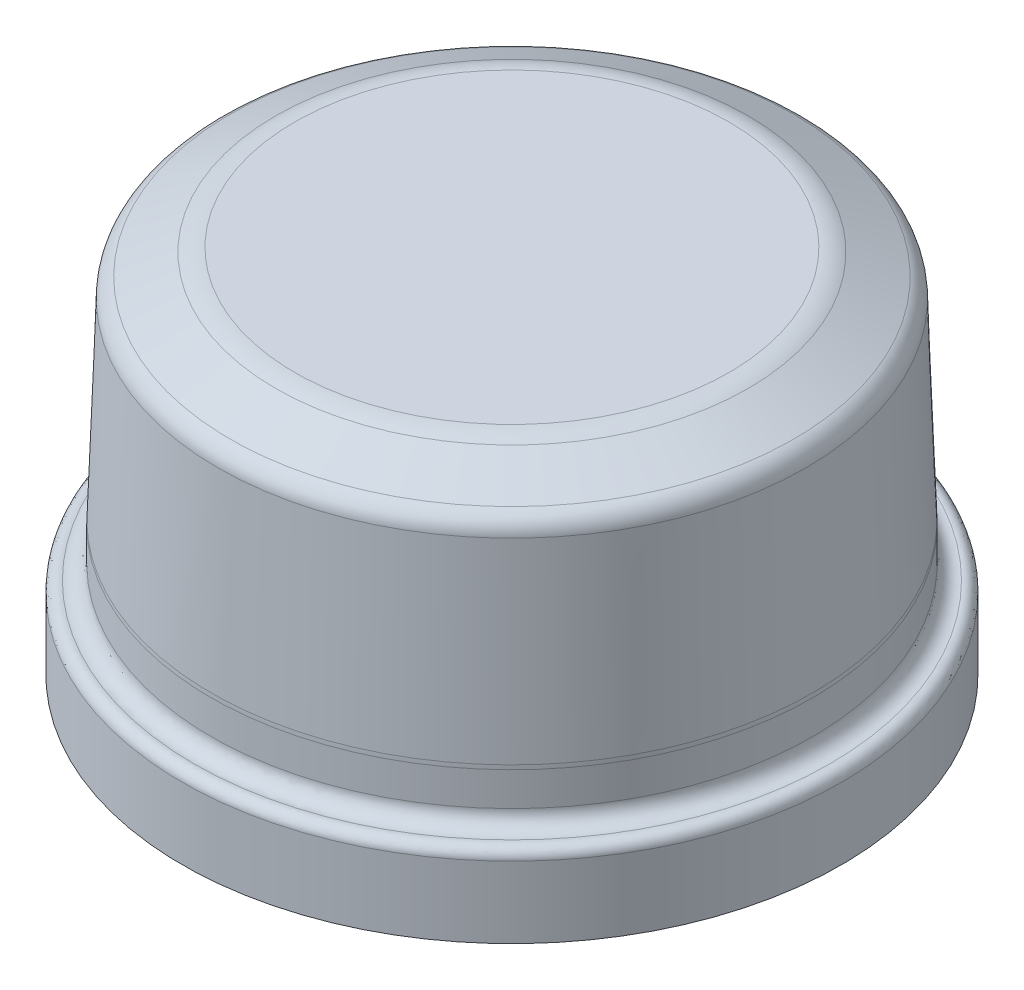
ISO-10303-21;
HEADER;
FILE_DESCRIPTION(('STEP AP214'),'2;1');
FILE_NAME('part.step','',(''),(''),'','','');
FILE_SCHEMA(('AUTOMOTIVE_DESIGN { 1 0 10303 214 1 1 1 1 }'));
ENDSEC;
DATA;
#1=APPLICATION_CONTEXT('core data for automotive mechanical design processes');
#2=APPLICATION_PROTOCOL_DEFINITION('international standard','automotive_design',2000,#1);
#3=PRODUCT_CONTEXT('',#1,'mechanical');
#4=PRODUCT('Part','Part','',(#3));
#5=PRODUCT_RELATED_PRODUCT_CATEGORY('part','',(#4));
#6=PRODUCT_DEFINITION_FORMATION('','',#4);
#7=PRODUCT_DEFINITION_CONTEXT('part definition',#1,'design');
#8=PRODUCT_DEFINITION('design','',#6,#7);
#9=PRODUCT_DEFINITION_SHAPE('','',#8);
#10=(LENGTH_UNIT() NAMED_UNIT(*) SI_UNIT(.MILLI.,.METRE.));
#11=(NAMED_UNIT(*) PLANE_ANGLE_UNIT() SI_UNIT($,.RADIAN.));
#12=(NAMED_UNIT(*) SI_UNIT($,.STERADIAN.) SOLID_ANGLE_UNIT());
#13=UNCERTAINTY_MEASURE_WITH_UNIT(LENGTH_MEASURE(1.E-05),#10,'distance_accuracy_value','');
#14=(GEOMETRIC_REPRESENTATION_CONTEXT(3) GLOBAL_UNCERTAINTY_ASSIGNED_CONTEXT((#13)) GLOBAL_UNIT_ASSIGNED_CONTEXT((#10,
#11,#12)) REPRESENTATION_CONTEXT('',''));
#15=CARTESIAN_POINT('',(0.,0.,0.));
#16=DIRECTION('',(0.,0.,1.));
#17=DIRECTION('',(1.,0.,0.));
#18=AXIS2_PLACEMENT_3D('',#15,#16,#17);
#19=CARTESIAN_POINT('',(0.,-142.400182818489,0.));
#20=DIRECTION('',(0.,1.,0.));
#21=DIRECTION('',(0.,0.,1.));
#22=AXIS2_PLACEMENT_3D('',#19,#20,#21);
#23=PLANE('',#22);
#24=CARTESIAN_POINT('',(0.,-142.400182818489,0.));
#25=DIRECTION('',(0.,-1.,0.));
#26=DIRECTION('',(0.,0.,-1.));
#27=AXIS2_PLACEMENT_3D('',#24,#25,#26);
#28=CIRCLE('',#27,135.227487940002);
#29=CARTESIAN_POINT('',(0.,-142.400182818489,-135.227487940002));
#30=VERTEX_POINT('',#29);
#31=EDGE_CURVE('E53',#30,#30,#28,.T.);
#32=ORIENTED_EDGE('',*,*,#31,.F.);
#33=EDGE_LOOP('',(#32));
#34=FACE_BOUND('',#33,.T.);
#35=CARTESIAN_POINT('',(0.,-142.400182818489,0.));
#36=DIRECTION('',(0.,-1.,0.));
#37=DIRECTION('',(0.,0.,-1.));
#38=AXIS2_PLACEMENT_3D('',#35,#36,#37);
#39=CIRCLE('',#38,138.427487940002);
#40=CARTESIAN_POINT('',(0.,-142.400182818489,-138.427487940002));
#41=VERTEX_POINT('',#40);
#42=EDGE_CURVE('E124',#41,#41,#39,.T.);
#43=ORIENTED_EDGE('',*,*,#42,.T.);
#44=EDGE_LOOP('',(#43));
#45=FACE_BOUND('',#44,.T.);
#46=ADVANCED_FACE('F35',(#34,#45),#23,.F.);
#47=CARTESIAN_POINT('',(0.,13.0472913738796,91.1860000000004));
#48=CARTESIAN_POINT('',(0.,13.0472913738796,93.9930756489206));
#49=CARTESIAN_POINT('',(0.,12.4331662406387,96.7096580848795));
#50=CARTESIAN_POINT('',(0.,11.2624547169268,99.2127252525065));
#51=(BOUNDED_CURVE() B_SPLINE_CURVE(3,(#47,#48,#49,#50),.UNSPECIFIED.,.F.,
.F.) B_SPLINE_CURVE_WITH_KNOTS((4,4),(0.,1.),
.UNSPECIFIED.) CURVE() GEOMETRIC_REPRESENTATION_ITEM() RATIONAL_B_SPLINE_CURVE((0.254333095030252,
0.254333095030252,0.258499793724843,0.266833191114025)) REPRESENTATION_ITEM(''));
#52=CARTESIAN_POINT('',(0.,55.,0.));
#53=DIRECTION('',(0.,-1.,0.));
#54=AXIS1_PLACEMENT('',#52,#53);
#55=SURFACE_OF_REVOLUTION('',#51,#54);
#56=OFFSET_SURFACE('',#55,-3.2,.F.);
#57=CARTESIAN_POINT('',(0.,8.36382953319206,0.));
#58=DIRECTION('',(0.,-1.,0.));
#59=DIRECTION('',(0.,0.,1.));
#60=AXIS2_PLACEMENT_3D('',#57,#58,#59);
#61=CIRCLE('',#60,97.8570069763817);
#62=CARTESIAN_POINT('',(0.,8.36382953319206,97.8570069763817));
#63=VERTEX_POINT('',#62);
#64=EDGE_CURVE('E42',#63,#63,#61,.T.);
#65=ORIENTED_EDGE('',*,*,#64,.T.);
#66=EDGE_LOOP('',(#65));
#67=FACE_BOUND('',#66,.T.);
#68=CARTESIAN_POINT('',(0.,9.84729137387958,0.));
#69=DIRECTION('',(0.,-1.,0.));
#70=DIRECTION('',(0.,0.,1.));
#71=AXIS2_PLACEMENT_3D('',#68,#69,#70);
#72=CIRCLE('',#71,91.1860000000004);
#73=CARTESIAN_POINT('',(0.,9.84729137387958,91.1860000000004));
#74=VERTEX_POINT('',#73);
#75=EDGE_CURVE('E10',#74,#74,#72,.T.);
#76=ORIENTED_EDGE('',*,*,#75,.F.);
#77=EDGE_LOOP('',(#76));
#78=FACE_BOUND('',#77,.T.);
#79=ADVANCED_FACE('F77',(#67,#78),#56,.F.);
#80=CARTESIAN_POINT('',(0.,2.24347505894726,0.));
#81=DIRECTION('',(0.,-1.,0.));
#82=DIRECTION('',(0.,0.,-1.));
#83=AXIS2_PLACEMENT_3D('',#80,#81,#82);
#84=CONICAL_SURFACE('',#83,110.942774074793,1.13331210913781);
#85=CARTESIAN_POINT('',(0.,-0.554291374192108,0.));
#86=DIRECTION('',(0.,-1.,0.));
#87=DIRECTION('',(0.,0.,-1.));
#88=AXIS2_PLACEMENT_3D('',#85,#86,#87);
#89=CIRCLE('',#88,116.924604064197);
#90=CARTESIAN_POINT('',(0.,-0.554291374192108,-116.924604064197));
#91=VERTEX_POINT('',#90);
#92=EDGE_CURVE('E47',#91,#91,#89,.T.);
#93=ORIENTED_EDGE('',*,*,#92,.T.);
#94=EDGE_LOOP('',(#93));
#95=FACE_BOUND('',#94,.T.);
#96=ORIENTED_EDGE('',*,*,#64,.F.);
#97=EDGE_LOOP('',(#96));
#98=FACE_BOUND('',#97,.T.);
#99=ADVANCED_FACE('F79',(#95,#98),#84,.F.);
#100=CARTESIAN_POINT('',(0.,-5.80804951971132,0.));
#101=DIRECTION('',(0.,-1.,0.));
#102=DIRECTION('',(0.,0.,-1.));
#103=AXIS2_PLACEMENT_3D('',#100,#101,#102);
#104=TOROIDAL_SURFACE('',#103,114.46736468872,5.8);
#105=CARTESIAN_POINT('',(0.,-5.60563243883684,0.));
#106=DIRECTION('',(0.,-1.,0.));
#107=DIRECTION('',(0.,0.,-1.));
#108=AXIS2_PLACEMENT_3D('',#105,#106,#107);
#109=CIRCLE('',#108,120.263831485431);
#110=CARTESIAN_POINT('',(0.,-5.60563243883684,-120.263831485431));
#111=VERTEX_POINT('',#110);
#112=EDGE_CURVE('E344',#111,#111,#109,.T.);
#113=ORIENTED_EDGE('',*,*,#112,.T.);
#114=EDGE_LOOP('',(#113));
#115=FACE_BOUND('',#114,.T.);
#116=ORIENTED_EDGE('',*,*,#92,.F.);
#117=EDGE_LOOP('',(#116));
#118=FACE_BOUND('',#117,.T.);
#119=ADVANCED_FACE('F82',(#115,#118),#104,.F.);
#120=CARTESIAN_POINT('',(0.,-5.60563243883685,0.));
#121=DIRECTION('',(0.,-1.,0.));
#122=DIRECTION('',(0.,0.,-1.));
#123=AXIS2_PLACEMENT_3D('',#120,#121,#122);
#124=CONICAL_SURFACE('',#123,120.263831485431,0.0349065850398867);
#125=CARTESIAN_POINT('',(0.,-86.0767033792557,0.));
#126=DIRECTION('',(0.,-1.,0.));
#127=DIRECTION('',(0.,0.,-1.));
#128=AXIS2_PLACEMENT_3D('',#125,#126,#127);
#129=CIRCLE('',#128,123.073943204496);
#130=CARTESIAN_POINT('',(0.,-86.0767033792557,-123.073943204496));
#131=VERTEX_POINT('',#130);
#132=EDGE_CURVE('E347',#131,#131,#129,.T.);
#133=ORIENTED_EDGE('',*,*,#132,.T.);
#134=EDGE_LOOP('',(#133));
#135=FACE_BOUND('',#134,.T.);
#136=ORIENTED_EDGE('',*,*,#112,.F.);
#137=EDGE_LOOP('',(#136));
#138=FACE_BOUND('',#137,.T.);
#139=ADVANCED_FACE('F86',(#135,#138),#124,.F.);
#140=CARTESIAN_POINT('',(0.,-87.709999824933,0.));
#141=DIRECTION('',(0.,-1.,0.));
#142=DIRECTION('',(0.,0.,-1.));
#143=AXIS2_PLACEMENT_3D('',#140,#141,#142);
#144=TOROIDAL_SURFACE('',#143,76.302452500002,46.8);
#145=CARTESIAN_POINT('',(0.,-87.7099998249327,0.));
#146=DIRECTION('',(0.,-1.,0.));
#147=DIRECTION('',(0.,0.,-1.));
#148=AXIS2_PLACEMENT_3D('',#145,#146,#147);
#149=CIRCLE('',#148,123.102452500002);
#150=CARTESIAN_POINT('',(0.,-87.7099998249327,-123.102452500002));
#151=VERTEX_POINT('',#150);
#152=EDGE_CURVE('E350',#151,#151,#149,.T.);
#153=ORIENTED_EDGE('',*,*,#152,.T.);
#154=EDGE_LOOP('',(#153));
#155=FACE_BOUND('',#154,.T.);
#156=ORIENTED_EDGE('',*,*,#132,.F.);
#157=EDGE_LOOP('',(#156));
#158=FACE_BOUND('',#157,.T.);
#159=ADVANCED_FACE('F90',(#155,#158),#144,.F.);
#160=CARTESIAN_POINT('',(0.,55.,0.));
#161=DIRECTION('',(0.,-1.,0.));
#162=DIRECTION('',(0.,0.,-1.));
#163=AXIS2_PLACEMENT_3D('',#160,#161,#162);
#164=CYLINDRICAL_SURFACE('',#163,123.102452500002);
#165=CARTESIAN_POINT('',(0.,-101.837246578522,0.));
#166=DIRECTION('',(0.,-1.,0.));
#167=DIRECTION('',(0.,0.,-1.));
#168=AXIS2_PLACEMENT_3D('',#165,#166,#167);
#169=CIRCLE('',#168,123.102452500002);
#170=CARTESIAN_POINT('',(0.,-101.837246578522,-123.102452500002));
#171=VERTEX_POINT('',#170);
#172=EDGE_CURVE('E353',#171,#171,#169,.T.);
#173=ORIENTED_EDGE('',*,*,#172,.T.);
#174=EDGE_LOOP('',(#173));
#175=FACE_BOUND('',#174,.T.);
#176=ORIENTED_EDGE('',*,*,#152,.F.);
#177=EDGE_LOOP('',(#176));
#178=FACE_BOUND('',#177,.T.);
#179=ADVANCED_FACE('F94',(#175,#178),#164,.F.);
#180=CARTESIAN_POINT('',(0.,-101.837246578522,126.302452500002));
#181=CARTESIAN_POINT('',(0.,-105.359484803612,126.302452500002));
#182=CARTESIAN_POINT('',(0.,-108.789131090786,128.834697888006));
#183=CARTESIAN_POINT('',(0.,-108.124708626121,133.519735500002));
#184=(BOUNDED_CURVE() B_SPLINE_CURVE(3,(#180,#181,#182,#183),.UNSPECIFIED.,.F.,
.F.) B_SPLINE_CURVE_WITH_KNOTS((4,4),(0.,1.),
.UNSPECIFIED.) CURVE() GEOMETRIC_REPRESENTATION_ITEM() RATIONAL_B_SPLINE_CURVE((0.508666190060503,
0.327183181081988,0.242825015050018,0.255591691964593)) REPRESENTATION_ITEM(''));
#185=CARTESIAN_POINT('',(0.,55.,0.));
#186=DIRECTION('',(0.,-1.,0.));
#187=AXIS1_PLACEMENT('',#185,#186);
#188=SURFACE_OF_REVOLUTION('',#184,#187);
#189=OFFSET_SURFACE('',#188,-3.2,.F.);
#190=CARTESIAN_POINT('',(0.,-111.293006305435,0.));
#191=DIRECTION('',(0.,-1.,0.));
#192=DIRECTION('',(0.,0.,1.));
#193=AXIS2_PLACEMENT_3D('',#190,#191,#192);
#194=CIRCLE('',#193,133.969057005446);
#195=CARTESIAN_POINT('',(0.,-111.293006305435,133.969057005446));
#196=VERTEX_POINT('',#195);
#197=EDGE_CURVE('E56',#196,#196,#194,.T.);
#198=ORIENTED_EDGE('',*,*,#197,.T.);
#199=EDGE_LOOP('',(#198));
#200=FACE_BOUND('',#199,.T.);
#201=ORIENTED_EDGE('',*,*,#172,.F.);
#202=EDGE_LOOP('',(#201));
#203=FACE_BOUND('',#202,.T.);
#204=ADVANCED_FACE('F98',(#200,#203),#189,.F.);
#205=CARTESIAN_POINT('',(0.,-108.124708626121,133.519735500002));
#206=CARTESIAN_POINT('',(0.,-107.672901350149,136.70556107616));
#207=CARTESIAN_POINT('',(0.,-110.005060825427,138.427487940002));
#208=CARTESIAN_POINT('',(0.,-112.400182818489,138.427487940002));
#209=(BOUNDED_CURVE() B_SPLINE_CURVE(3,(#205,#206,#207,#208),.UNSPECIFIED.,.F.,
.F.) B_SPLINE_CURVE_WITH_KNOTS((4,4),(0.,1.),
.UNSPECIFIED.) CURVE() GEOMETRIC_REPRESENTATION_ITEM() RATIONAL_B_SPLINE_CURVE((0.255591691964592,
0.242825015050017,0.327183181081988,0.508666190060503)) REPRESENTATION_ITEM(''));
#210=CARTESIAN_POINT('',(0.,55.,0.));
#211=DIRECTION('',(0.,-1.,0.));
#212=AXIS1_PLACEMENT('',#210,#211);
#213=SURFACE_OF_REVOLUTION('',#209,#212);
#214=OFFSET_SURFACE('',#213,-3.2,.F.);
#215=CARTESIAN_POINT('',(0.,-112.400182818488,0.));
#216=DIRECTION('',(0.,-1.,0.));
#217=DIRECTION('',(0.,0.,1.));
#218=AXIS2_PLACEMENT_3D('',#215,#216,#217);
#219=CIRCLE('',#218,135.227487940002);
#220=CARTESIAN_POINT('',(0.,-112.400182818488,135.227487940002));
#221=VERTEX_POINT('',#220);
#222=EDGE_CURVE('E51',#221,#221,#219,.T.);
#223=ORIENTED_EDGE('',*,*,#222,.T.);
#224=EDGE_LOOP('',(#223));
#225=FACE_BOUND('',#224,.T.);
#226=ORIENTED_EDGE('',*,*,#197,.F.);
#227=EDGE_LOOP('',(#226));
#228=FACE_BOUND('',#227,.T.);
#229=ADVANCED_FACE('F102',(#225,#228),#214,.F.);
#230=CARTESIAN_POINT('',(0.,55.,0.));
#231=DIRECTION('',(0.,-1.,0.));
#232=DIRECTION('',(0.,0.,-1.));
#233=AXIS2_PLACEMENT_3D('',#230,#231,#232);
#234=CYLINDRICAL_SURFACE('',#233,135.227487940002);
#235=ORIENTED_EDGE('',*,*,#31,.T.);
#236=EDGE_LOOP('',(#235));
#237=FACE_BOUND('',#236,.T.);
#238=ORIENTED_EDGE('',*,*,#222,.F.);
#239=EDGE_LOOP('',(#238));
#240=FACE_BOUND('',#239,.T.);
#241=ADVANCED_FACE('F75',(#237,#240),#234,.F.);
#242=CARTESIAN_POINT('',(0.,13.0472913738796,91.1860000000004));
#243=CARTESIAN_POINT('',(0.,13.0472913738796,93.9930756489206));
#244=CARTESIAN_POINT('',(0.,12.4331662406387,96.7096580848795));
#245=CARTESIAN_POINT('',(0.,11.2624547169268,99.2127252525065));
#246=(BOUNDED_CURVE() B_SPLINE_CURVE(3,(#242,#243,#244,#245),.UNSPECIFIED.,.F.,
.F.) B_SPLINE_CURVE_WITH_KNOTS((4,4),(0.,1.),
.UNSPECIFIED.) CURVE() GEOMETRIC_REPRESENTATION_ITEM() RATIONAL_B_SPLINE_CURVE((0.254333095030252,
0.254333095030252,0.258499793724843,0.266833191114025)) REPRESENTATION_ITEM(''));
#247=CARTESIAN_POINT('',(0.,55.,0.));
#248=DIRECTION('',(0.,-1.,0.));
#249=AXIS1_PLACEMENT('',#247,#248);
#250=SURFACE_OF_REVOLUTION('',#246,#249);
#251=CARTESIAN_POINT('',(0.,11.2624547169268,0.));
#252=DIRECTION('',(0.,-1.,0.));
#253=DIRECTION('',(0.,0.,-1.));
#254=AXIS2_PLACEMENT_3D('',#251,#252,#253);
#255=CIRCLE('',#254,99.2127252525065);
#256=CARTESIAN_POINT('',(0.,11.2624547169268,-99.2127252525065));
#257=VERTEX_POINT('',#256);
#258=EDGE_CURVE('E38',#257,#257,#255,.T.);
#259=ORIENTED_EDGE('',*,*,#258,.F.);
#260=EDGE_LOOP('',(#259));
#261=FACE_BOUND('',#260,.T.);
#262=CARTESIAN_POINT('',(0.,13.0472913738796,0.));
#263=DIRECTION('',(0.,-1.,0.));
#264=DIRECTION('',(0.,0.,-1.));
#265=AXIS2_PLACEMENT_3D('',#262,#263,#264);
#266=CIRCLE('',#265,91.1860000000005);
#267=CARTESIAN_POINT('',(0.,13.0472913738796,-91.1860000000005));
#268=VERTEX_POINT('',#267);
#269=EDGE_CURVE('E134',#268,#268,#266,.T.);
#270=ORIENTED_EDGE('',*,*,#269,.T.);
#271=EDGE_LOOP('',(#270));
#272=FACE_BOUND('',#271,.T.);
#273=ADVANCED_FACE('F69',(#261,#272),#250,.T.);
#274=CARTESIAN_POINT('',(0.,5.14210024268198,0.));
#275=DIRECTION('',(0.,-1.,0.));
#276=DIRECTION('',(0.,0.,-1.));
#277=AXIS2_PLACEMENT_3D('',#274,#275,#276);
#278=CONICAL_SURFACE('',#277,112.298492350918,1.13331210913781);
#279=CARTESIAN_POINT('',(0.,2.34433380954262,0.));
#280=DIRECTION('',(0.,-1.,0.));
#281=DIRECTION('',(0.,0.,-1.));
#282=AXIS2_PLACEMENT_3D('',#279,#280,#281);
#283=CIRCLE('',#282,118.280322340321);
#284=CARTESIAN_POINT('',(0.,2.34433380954262,-118.280322340321));
#285=VERTEX_POINT('',#284);
#286=EDGE_CURVE('E148',#285,#285,#283,.T.);
#287=ORIENTED_EDGE('',*,*,#286,.F.);
#288=EDGE_LOOP('',(#287));
#289=FACE_BOUND('',#288,.T.);
#290=ORIENTED_EDGE('',*,*,#258,.T.);
#291=EDGE_LOOP('',(#290));
#292=FACE_BOUND('',#291,.T.);
#293=ADVANCED_FACE('F74',(#289,#292),#278,.T.);
#294=CARTESIAN_POINT('',(0.,-5.80804951971132,0.));
#295=DIRECTION('',(0.,-1.,0.));
#296=DIRECTION('',(0.,0.,-1.));
#297=AXIS2_PLACEMENT_3D('',#294,#295,#296);
#298=TOROIDAL_SURFACE('',#297,114.46736468872,9.);
#299=CARTESIAN_POINT('',(0.,-5.49395404938885,0.));
#300=DIRECTION('',(0.,-1.,0.));
#301=DIRECTION('',(0.,0.,-1.));
#302=AXIS2_PLACEMENT_3D('',#299,#300,#301);
#303=CIRCLE('',#302,123.461882131892);
#304=CARTESIAN_POINT('',(0.,-5.49395404938885,-123.461882131892));
#305=VERTEX_POINT('',#304);
#306=EDGE_CURVE('E146',#305,#305,#303,.T.);
#307=ORIENTED_EDGE('',*,*,#306,.F.);
#308=EDGE_LOOP('',(#307));
#309=FACE_BOUND('',#308,.T.);
#310=ORIENTED_EDGE('',*,*,#286,.T.);
#311=EDGE_LOOP('',(#310));
#312=FACE_BOUND('',#311,.T.);
#313=ADVANCED_FACE('F196',(#309,#312),#298,.T.);
#314=CARTESIAN_POINT('',(0.,-5.49395404938885,0.));
#315=DIRECTION('',(0.,-1.,0.));
#316=DIRECTION('',(0.,0.,-1.));
#317=AXIS2_PLACEMENT_3D('',#314,#315,#316);
#318=CONICAL_SURFACE('',#317,123.461882131892,0.0349065850398867);
#319=CARTESIAN_POINT('',(0.,-85.9650249898077,0.));
#320=DIRECTION('',(0.,-1.,0.));
#321=DIRECTION('',(0.,0.,-1.));
#322=AXIS2_PLACEMENT_3D('',#319,#320,#321);
#323=CIRCLE('',#322,126.271993850957);
#324=CARTESIAN_POINT('',(0.,-85.9650249898077,-126.271993850957));
#325=VERTEX_POINT('',#324);
#326=EDGE_CURVE('E143',#325,#325,#323,.T.);
#327=ORIENTED_EDGE('',*,*,#326,.F.);
#328=EDGE_LOOP('',(#327));
#329=FACE_BOUND('',#328,.T.);
#330=ORIENTED_EDGE('',*,*,#306,.T.);
#331=EDGE_LOOP('',(#330));
#332=FACE_BOUND('',#331,.T.);
#333=ADVANCED_FACE('F190',(#329,#332),#318,.T.);
#334=CARTESIAN_POINT('',(0.,-87.709999824933,0.));
#335=DIRECTION('',(0.,-1.,0.));
#336=DIRECTION('',(0.,0.,-1.));
#337=AXIS2_PLACEMENT_3D('',#334,#335,#336);
#338=TOROIDAL_SURFACE('',#337,76.302452500002,50.);
#339=CARTESIAN_POINT('',(0.,-87.7099998249327,0.));
#340=DIRECTION('',(0.,-1.,0.));
#341=DIRECTION('',(0.,0.,-1.));
#342=AXIS2_PLACEMENT_3D('',#339,#340,#341);
#343=CIRCLE('',#342,126.302452500002);
#344=CARTESIAN_POINT('',(0.,-87.7099998249327,-126.302452500002));
#345=VERTEX_POINT('',#344);
#346=EDGE_CURVE('E140',#345,#345,#343,.T.);
#347=ORIENTED_EDGE('',*,*,#346,.F.);
#348=EDGE_LOOP('',(#347));
#349=FACE_BOUND('',#348,.T.);
#350=ORIENTED_EDGE('',*,*,#326,.T.);
#351=EDGE_LOOP('',(#350));
#352=FACE_BOUND('',#351,.T.);
#353=ADVANCED_FACE('F184',(#349,#352),#338,.T.);
#354=CARTESIAN_POINT('',(0.,55.,0.));
#355=DIRECTION('',(0.,-1.,0.));
#356=DIRECTION('',(0.,0.,-1.));
#357=AXIS2_PLACEMENT_3D('',#354,#355,#356);
#358=CYLINDRICAL_SURFACE('',#357,126.302452500002);
#359=CARTESIAN_POINT('',(0.,-101.837246578522,0.));
#360=DIRECTION('',(0.,-1.,0.));
#361=DIRECTION('',(0.,0.,-1.));
#362=AXIS2_PLACEMENT_3D('',#359,#360,#361);
#363=CIRCLE('',#362,126.302452500002);
#364=CARTESIAN_POINT('',(0.,-101.837246578522,-126.302452500002));
#365=VERTEX_POINT('',#364);
#366=EDGE_CURVE('E137',#365,#365,#363,.T.);
#367=ORIENTED_EDGE('',*,*,#366,.F.);
#368=EDGE_LOOP('',(#367));
#369=FACE_BOUND('',#368,.T.);
#370=ORIENTED_EDGE('',*,*,#346,.T.);
#371=EDGE_LOOP('',(#370));
#372=FACE_BOUND('',#371,.T.);
#373=ADVANCED_FACE('F109',(#369,#372),#358,.T.);
#374=CARTESIAN_POINT('',(0.,-101.837246578522,126.302452500002));
#375=CARTESIAN_POINT('',(0.,-105.359484803612,126.302452500002));
#376=CARTESIAN_POINT('',(0.,-108.789131090786,128.834697888006));
#377=CARTESIAN_POINT('',(0.,-108.124708626121,133.519735500002));
#378=(BOUNDED_CURVE() B_SPLINE_CURVE(3,(#374,#375,#376,#377),.UNSPECIFIED.,.F.,
.F.) B_SPLINE_CURVE_WITH_KNOTS((4,4),(0.,1.),
.UNSPECIFIED.) CURVE() GEOMETRIC_REPRESENTATION_ITEM() RATIONAL_B_SPLINE_CURVE((0.508666190060503,
0.327183181081988,0.242825015050018,0.255591691964593)) REPRESENTATION_ITEM(''));
#379=CARTESIAN_POINT('',(0.,55.,0.));
#380=DIRECTION('',(0.,-1.,0.));
#381=AXIS1_PLACEMENT('',#379,#380);
#382=SURFACE_OF_REVOLUTION('',#378,#381);
#383=CARTESIAN_POINT('',(0.,-108.124708626121,0.));
#384=DIRECTION('',(0.,-1.,0.));
#385=DIRECTION('',(0.,0.,-1.));
#386=AXIS2_PLACEMENT_3D('',#383,#384,#385);
#387=CIRCLE('',#386,133.519735500002);
#388=CARTESIAN_POINT('',(0.,-108.124708626121,-133.519735500002));
#389=VERTEX_POINT('',#388);
#390=EDGE_CURVE('E130',#389,#389,#387,.T.);
#391=ORIENTED_EDGE('',*,*,#390,.F.);
#392=EDGE_LOOP('',(#391));
#393=FACE_BOUND('',#392,.T.);
#394=ORIENTED_EDGE('',*,*,#366,.T.);
#395=EDGE_LOOP('',(#394));
#396=FACE_BOUND('',#395,.T.);
#397=ADVANCED_FACE('F104',(#393,#396),#382,.T.);
#398=CARTESIAN_POINT('',(0.,-108.124708626121,133.519735500002));
#399=CARTESIAN_POINT('',(0.,-107.672901350149,136.70556107616));
#400=CARTESIAN_POINT('',(0.,-110.005060825427,138.427487940002));
#401=CARTESIAN_POINT('',(0.,-112.400182818489,138.427487940002));
#402=(BOUNDED_CURVE() B_SPLINE_CURVE(3,(#398,#399,#400,#401),.UNSPECIFIED.,.F.,
.F.) B_SPLINE_CURVE_WITH_KNOTS((4,4),(0.,1.),
.UNSPECIFIED.) CURVE() GEOMETRIC_REPRESENTATION_ITEM() RATIONAL_B_SPLINE_CURVE((0.255591691964592,
0.242825015050017,0.327183181081988,0.508666190060503)) REPRESENTATION_ITEM(''));
#403=CARTESIAN_POINT('',(0.,55.,0.));
#404=DIRECTION('',(0.,-1.,0.));
#405=AXIS1_PLACEMENT('',#403,#404);
#406=SURFACE_OF_REVOLUTION('',#402,#405);
#407=CARTESIAN_POINT('',(0.,-112.400182818489,0.));
#408=DIRECTION('',(0.,-1.,0.));
#409=DIRECTION('',(0.,0.,-1.));
#410=AXIS2_PLACEMENT_3D('',#407,#408,#409);
#411=CIRCLE('',#410,138.427487940002);
#412=CARTESIAN_POINT('',(0.,-112.400182818489,-138.427487940002));
#413=VERTEX_POINT('',#412);
#414=EDGE_CURVE('E131',#413,#413,#411,.T.);
#415=ORIENTED_EDGE('',*,*,#414,.F.);
#416=EDGE_LOOP('',(#415));
#417=FACE_BOUND('',#416,.T.);
#418=ORIENTED_EDGE('',*,*,#390,.T.);
#419=EDGE_LOOP('',(#418));
#420=FACE_BOUND('',#419,.T.);
#421=ADVANCED_FACE('F108',(#417,#420),#406,.T.);
#422=CARTESIAN_POINT('',(0.,55.,0.));
#423=DIRECTION('',(0.,-1.,0.));
#424=DIRECTION('',(0.,0.,-1.));
#425=AXIS2_PLACEMENT_3D('',#422,#423,#424);
#426=CYLINDRICAL_SURFACE('',#425,138.427487940002);
#427=ORIENTED_EDGE('',*,*,#42,.F.);
#428=EDGE_LOOP('',(#427));
#429=FACE_BOUND('',#428,.T.);
#430=ORIENTED_EDGE('',*,*,#414,.T.);
#431=EDGE_LOOP('',(#430));
#432=FACE_BOUND('',#431,.T.);
#433=ADVANCED_FACE('F117',(#429,#432),#426,.T.);
#434=CARTESIAN_POINT('',(0.,13.0472913738795,91.1860000000005));
#435=DIRECTION('',(0.,1.,0.));
#436=DIRECTION('',(0.,0.,1.));
#437=AXIS2_PLACEMENT_3D('',#434,#435,#436);
#438=PLANE('',#437);
#439=ORIENTED_EDGE('',*,*,#269,.F.);
#440=EDGE_LOOP('',(#439));
#441=FACE_BOUND('',#440,.T.);
#442=ADVANCED_FACE('F175',(#441),#438,.T.);
#443=CARTESIAN_POINT('',(0.,9.84729137387952,91.1860000000005));
#444=DIRECTION('',(0.,1.,0.));
#445=DIRECTION('',(0.,0.,1.));
#446=AXIS2_PLACEMENT_3D('',#443,#444,#445);
#447=PLANE('',#446);
#448=ORIENTED_EDGE('',*,*,#75,.T.);
#449=EDGE_LOOP('',(#448));
#450=FACE_BOUND('',#449,.T.);
#451=ADVANCED_FACE('F315',(#450),#447,.F.);
#452=CLOSED_SHELL('',(#46,#79,#99,#119,#139,#159,#179,#204,#229,#241,#273,#293,#313,#333,#353,
#373,#397,#421,#433,#442,#451));
#453=MANIFOLD_SOLID_BREP('B2',#452);
#454=ADVANCED_BREP_SHAPE_REPRESENTATION('',(#18,#453),#14);
#455=SHAPE_DEFINITION_REPRESENTATION(#9,#454);
ENDSEC;
END-ISO-10303-21;
